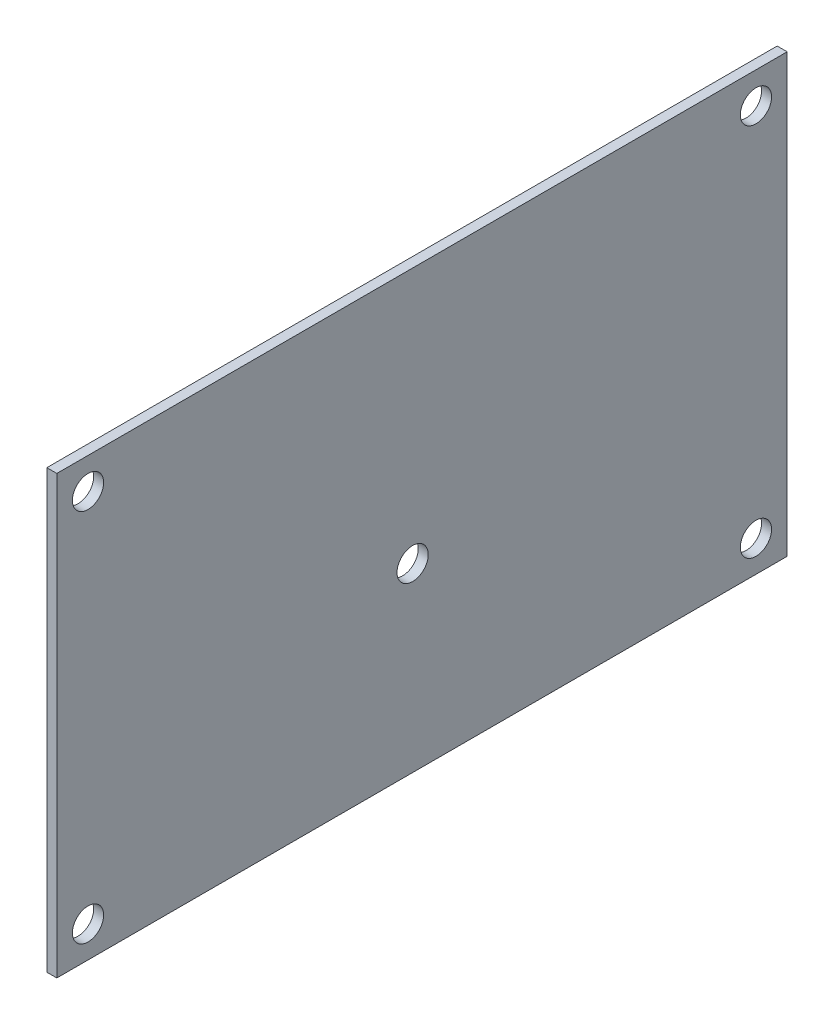
ISO-10303-21;
HEADER;
FILE_DESCRIPTION(('STEP AP214'),'2;1');
FILE_NAME('part.step','',(''),(''),'','','');
FILE_SCHEMA(('AUTOMOTIVE_DESIGN { 1 0 10303 214 1 1 1 1 }'));
ENDSEC;
DATA;
#1=APPLICATION_CONTEXT('core data for automotive mechanical design processes');
#2=APPLICATION_PROTOCOL_DEFINITION('international standard','automotive_design',2000,#1);
#3=PRODUCT_CONTEXT('',#1,'mechanical');
#4=PRODUCT('Part','Part','',(#3));
#5=PRODUCT_RELATED_PRODUCT_CATEGORY('part','',(#4));
#6=PRODUCT_DEFINITION_FORMATION('','',#4);
#7=PRODUCT_DEFINITION_CONTEXT('part definition',#1,'design');
#8=PRODUCT_DEFINITION('design','',#6,#7);
#9=PRODUCT_DEFINITION_SHAPE('','',#8);
#10=(LENGTH_UNIT() NAMED_UNIT(*) SI_UNIT(.MILLI.,.METRE.));
#11=(NAMED_UNIT(*) PLANE_ANGLE_UNIT() SI_UNIT($,.RADIAN.));
#12=(NAMED_UNIT(*) SI_UNIT($,.STERADIAN.) SOLID_ANGLE_UNIT());
#13=UNCERTAINTY_MEASURE_WITH_UNIT(LENGTH_MEASURE(1.E-05),#10,'distance_accuracy_value','');
#14=(GEOMETRIC_REPRESENTATION_CONTEXT(3) GLOBAL_UNCERTAINTY_ASSIGNED_CONTEXT((#13)) GLOBAL_UNIT_ASSIGNED_CONTEXT((#10,
#11,#12)) REPRESENTATION_CONTEXT('',''));
#15=CARTESIAN_POINT('',(0.,0.,0.));
#16=DIRECTION('',(0.,0.,1.));
#17=DIRECTION('',(1.,0.,0.));
#18=AXIS2_PLACEMENT_3D('',#15,#16,#17);
#19=CARTESIAN_POINT('',(1.6,0.,0.));
#20=DIRECTION('',(0.,0.,-1.));
#21=DIRECTION('',(0.,1.,0.));
#22=AXIS2_PLACEMENT_3D('',#19,#20,#21);
#23=PLANE('',#22);
#24=DIRECTION('',(0.,-1.,0.));
#25=VECTOR('',#24,1.);
#26=CARTESIAN_POINT('',(0.,0.,0.));
#27=LINE('',#26,#25);
#28=CARTESIAN_POINT('',(0.,70.,0.));
#29=VERTEX_POINT('',#28);
#30=CARTESIAN_POINT('',(0.,0.,0.));
#31=VERTEX_POINT('',#30);
#32=EDGE_CURVE('E95',#29,#31,#27,.T.);
#33=ORIENTED_EDGE('',*,*,#32,.T.);
#34=DIRECTION('',(-1.,0.,0.));
#35=VECTOR('',#34,1.);
#36=CARTESIAN_POINT('',(1.6,0.,0.));
#37=LINE('',#36,#35);
#38=CARTESIAN_POINT('',(1.6,0.,0.));
#39=VERTEX_POINT('',#38);
#40=EDGE_CURVE('E11',#39,#31,#37,.T.);
#41=ORIENTED_EDGE('',*,*,#40,.F.);
#42=DIRECTION('',(0.,-1.,0.));
#43=VECTOR('',#42,1.);
#44=CARTESIAN_POINT('',(1.6,0.,0.));
#45=LINE('',#44,#43);
#46=CARTESIAN_POINT('',(1.6,70.,0.));
#47=VERTEX_POINT('',#46);
#48=EDGE_CURVE('E83',#47,#39,#45,.T.);
#49=ORIENTED_EDGE('',*,*,#48,.F.);
#50=DIRECTION('',(-1.,0.,0.));
#51=VECTOR('',#50,1.);
#52=CARTESIAN_POINT('',(1.6,70.,0.));
#53=LINE('',#52,#51);
#54=EDGE_CURVE('E91',#47,#29,#53,.T.);
#55=ORIENTED_EDGE('',*,*,#54,.T.);
#56=EDGE_LOOP('',(#33,#41,#49,#55));
#57=FACE_BOUND('',#56,.T.);
#58=ADVANCED_FACE('F32',(#57),#23,.F.);
#59=CARTESIAN_POINT('',(1.6,0.,0.));
#60=DIRECTION('',(0.,1.,0.));
#61=DIRECTION('',(0.,0.,1.));
#62=AXIS2_PLACEMENT_3D('',#59,#60,#61);
#63=PLANE('',#62);
#64=DIRECTION('',(0.,0.,-1.));
#65=VECTOR('',#64,1.);
#66=CARTESIAN_POINT('',(0.,0.,0.));
#67=LINE('',#66,#65);
#68=CARTESIAN_POINT('',(0.,0.,-117.));
#69=VERTEX_POINT('',#68);
#70=EDGE_CURVE('E87',#31,#69,#67,.T.);
#71=ORIENTED_EDGE('',*,*,#70,.T.);
#72=DIRECTION('',(-1.,0.,0.));
#73=VECTOR('',#72,1.);
#74=CARTESIAN_POINT('',(1.6,0.,-117.));
#75=LINE('',#74,#73);
#76=CARTESIAN_POINT('',(1.6,0.,-117.));
#77=VERTEX_POINT('',#76);
#78=EDGE_CURVE('E40',#77,#69,#75,.T.);
#79=ORIENTED_EDGE('',*,*,#78,.F.);
#80=DIRECTION('',(0.,0.,-1.));
#81=VECTOR('',#80,1.);
#82=CARTESIAN_POINT('',(1.6,0.,0.));
#83=LINE('',#82,#81);
#84=EDGE_CURVE('E78',#39,#77,#83,.T.);
#85=ORIENTED_EDGE('',*,*,#84,.F.);
#86=ORIENTED_EDGE('',*,*,#40,.T.);
#87=EDGE_LOOP('',(#71,#79,#85,#86));
#88=FACE_BOUND('',#87,.T.);
#89=ADVANCED_FACE('F86',(#88),#63,.F.);
#90=CARTESIAN_POINT('',(1.6,0.,-117.));
#91=DIRECTION('',(0.,0.,1.));
#92=DIRECTION('',(0.,-1.,0.));
#93=AXIS2_PLACEMENT_3D('',#90,#91,#92);
#94=PLANE('',#93);
#95=DIRECTION('',(0.,1.,0.));
#96=VECTOR('',#95,1.);
#97=CARTESIAN_POINT('',(0.,0.,-117.));
#98=LINE('',#97,#96);
#99=CARTESIAN_POINT('',(0.,70.,-117.));
#100=VERTEX_POINT('',#99);
#101=EDGE_CURVE('E65',#69,#100,#98,.T.);
#102=ORIENTED_EDGE('',*,*,#101,.T.);
#103=DIRECTION('',(-1.,0.,0.));
#104=VECTOR('',#103,1.);
#105=CARTESIAN_POINT('',(1.6,70.,-117.));
#106=LINE('',#105,#104);
#107=CARTESIAN_POINT('',(1.6,70.,-117.));
#108=VERTEX_POINT('',#107);
#109=EDGE_CURVE('E88',#108,#100,#106,.T.);
#110=ORIENTED_EDGE('',*,*,#109,.F.);
#111=DIRECTION('',(0.,1.,0.));
#112=VECTOR('',#111,1.);
#113=CARTESIAN_POINT('',(1.6,0.,-117.));
#114=LINE('',#113,#112);
#115=EDGE_CURVE('E81',#77,#108,#114,.T.);
#116=ORIENTED_EDGE('',*,*,#115,.F.);
#117=ORIENTED_EDGE('',*,*,#78,.T.);
#118=EDGE_LOOP('',(#102,#110,#116,#117));
#119=FACE_BOUND('',#118,.T.);
#120=ADVANCED_FACE('F89',(#119),#94,.F.);
#121=CARTESIAN_POINT('',(1.6,70.,0.));
#122=DIRECTION('',(0.,-1.,0.));
#123=DIRECTION('',(0.,0.,-1.));
#124=AXIS2_PLACEMENT_3D('',#121,#122,#123);
#125=PLANE('',#124);
#126=DIRECTION('',(0.,0.,1.));
#127=VECTOR('',#126,1.);
#128=CARTESIAN_POINT('',(0.,70.,0.));
#129=LINE('',#128,#127);
#130=EDGE_CURVE('E71',#100,#29,#129,.T.);
#131=ORIENTED_EDGE('',*,*,#130,.T.);
#132=ORIENTED_EDGE('',*,*,#54,.F.);
#133=DIRECTION('',(0.,0.,1.));
#134=VECTOR('',#133,1.);
#135=CARTESIAN_POINT('',(1.6,70.,0.));
#136=LINE('',#135,#134);
#137=EDGE_CURVE('E48',#108,#47,#136,.T.);
#138=ORIENTED_EDGE('',*,*,#137,.F.);
#139=ORIENTED_EDGE('',*,*,#109,.T.);
#140=EDGE_LOOP('',(#131,#132,#138,#139));
#141=FACE_BOUND('',#140,.T.);
#142=ADVANCED_FACE('F103',(#141),#125,.F.);
#143=CARTESIAN_POINT('',(1.6,0.,0.));
#144=DIRECTION('',(-1.,0.,0.));
#145=DIRECTION('',(0.,0.,1.));
#146=AXIS2_PLACEMENT_3D('',#143,#144,#145);
#147=PLANE('',#146);
#148=CARTESIAN_POINT('',(1.6,29.,-57.));
#149=DIRECTION('',(1.,0.,0.));
#150=DIRECTION('',(0.,0.,-1.));
#151=AXIS2_PLACEMENT_3D('',#148,#149,#150);
#152=CIRCLE('',#151,2.5);
#153=CARTESIAN_POINT('',(1.6,29.,-59.5));
#154=VERTEX_POINT('',#153);
#155=EDGE_CURVE('E133',#154,#154,#152,.T.);
#156=ORIENTED_EDGE('',*,*,#155,.F.);
#157=EDGE_LOOP('',(#156));
#158=FACE_BOUND('',#157,.T.);
#159=CARTESIAN_POINT('',(1.6,65.,-112.));
#160=DIRECTION('',(1.,0.,0.));
#161=DIRECTION('',(0.,0.,-1.));
#162=AXIS2_PLACEMENT_3D('',#159,#160,#161);
#163=CIRCLE('',#162,2.50000000000001);
#164=CARTESIAN_POINT('',(1.6,65.,-114.5));
#165=VERTEX_POINT('',#164);
#166=EDGE_CURVE('E127',#165,#165,#163,.T.);
#167=ORIENTED_EDGE('',*,*,#166,.F.);
#168=EDGE_LOOP('',(#167));
#169=FACE_BOUND('',#168,.T.);
#170=CARTESIAN_POINT('',(1.6,5.,-112.));
#171=DIRECTION('',(1.,0.,0.));
#172=DIRECTION('',(0.,0.,-1.));
#173=AXIS2_PLACEMENT_3D('',#170,#171,#172);
#174=CIRCLE('',#173,2.49999999999999);
#175=CARTESIAN_POINT('',(1.6,5.,-114.5));
#176=VERTEX_POINT('',#175);
#177=EDGE_CURVE('E121',#176,#176,#174,.T.);
#178=ORIENTED_EDGE('',*,*,#177,.F.);
#179=EDGE_LOOP('',(#178));
#180=FACE_BOUND('',#179,.T.);
#181=CARTESIAN_POINT('',(1.6,5.,-4.99999999999997));
#182=DIRECTION('',(1.,0.,0.));
#183=DIRECTION('',(0.,0.,-1.));
#184=AXIS2_PLACEMENT_3D('',#181,#182,#183);
#185=CIRCLE('',#184,2.5);
#186=CARTESIAN_POINT('',(1.6,5.,-7.49999999999997));
#187=VERTEX_POINT('',#186);
#188=EDGE_CURVE('E115',#187,#187,#185,.T.);
#189=ORIENTED_EDGE('',*,*,#188,.F.);
#190=EDGE_LOOP('',(#189));
#191=FACE_BOUND('',#190,.T.);
#192=CARTESIAN_POINT('',(1.6,65.,-4.99999999999997));
#193=DIRECTION('',(1.,0.,0.));
#194=DIRECTION('',(0.,0.,-1.));
#195=AXIS2_PLACEMENT_3D('',#192,#193,#194);
#196=CIRCLE('',#195,2.5);
#197=CARTESIAN_POINT('',(1.6,65.,-7.49999999999997));
#198=VERTEX_POINT('',#197);
#199=EDGE_CURVE('E109',#198,#198,#196,.T.);
#200=ORIENTED_EDGE('',*,*,#199,.F.);
#201=EDGE_LOOP('',(#200));
#202=FACE_BOUND('',#201,.T.);
#203=ORIENTED_EDGE('',*,*,#48,.T.);
#204=ORIENTED_EDGE('',*,*,#84,.T.);
#205=ORIENTED_EDGE('',*,*,#115,.T.);
#206=ORIENTED_EDGE('',*,*,#137,.T.);
#207=EDGE_LOOP('',(#203,#204,#205,#206));
#208=FACE_BOUND('',#207,.T.);
#209=ADVANCED_FACE('F79',(#158,#169,#180,#191,#202,#208),#147,.F.);
#210=CARTESIAN_POINT('',(0.,0.,0.));
#211=DIRECTION('',(-1.,0.,0.));
#212=DIRECTION('',(0.,0.,1.));
#213=AXIS2_PLACEMENT_3D('',#210,#211,#212);
#214=PLANE('',#213);
#215=CARTESIAN_POINT('',(0.,29.,-57.));
#216=DIRECTION('',(1.,0.,0.));
#217=DIRECTION('',(0.,0.,-1.));
#218=AXIS2_PLACEMENT_3D('',#215,#216,#217);
#219=CIRCLE('',#218,2.5);
#220=CARTESIAN_POINT('',(0.,29.,-59.5));
#221=VERTEX_POINT('',#220);
#222=EDGE_CURVE('E130',#221,#221,#219,.T.);
#223=ORIENTED_EDGE('',*,*,#222,.T.);
#224=EDGE_LOOP('',(#223));
#225=FACE_BOUND('',#224,.T.);
#226=CARTESIAN_POINT('',(0.,65.,-112.));
#227=DIRECTION('',(1.,0.,0.));
#228=DIRECTION('',(0.,0.,-1.));
#229=AXIS2_PLACEMENT_3D('',#226,#227,#228);
#230=CIRCLE('',#229,2.50000000000001);
#231=CARTESIAN_POINT('',(0.,65.,-114.5));
#232=VERTEX_POINT('',#231);
#233=EDGE_CURVE('E124',#232,#232,#230,.T.);
#234=ORIENTED_EDGE('',*,*,#233,.T.);
#235=EDGE_LOOP('',(#234));
#236=FACE_BOUND('',#235,.T.);
#237=CARTESIAN_POINT('',(0.,5.,-112.));
#238=DIRECTION('',(1.,0.,0.));
#239=DIRECTION('',(0.,0.,-1.));
#240=AXIS2_PLACEMENT_3D('',#237,#238,#239);
#241=CIRCLE('',#240,2.49999999999999);
#242=CARTESIAN_POINT('',(0.,5.,-114.5));
#243=VERTEX_POINT('',#242);
#244=EDGE_CURVE('E118',#243,#243,#241,.T.);
#245=ORIENTED_EDGE('',*,*,#244,.T.);
#246=EDGE_LOOP('',(#245));
#247=FACE_BOUND('',#246,.T.);
#248=CARTESIAN_POINT('',(0.,5.,-4.99999999999997));
#249=DIRECTION('',(1.,0.,0.));
#250=DIRECTION('',(0.,0.,-1.));
#251=AXIS2_PLACEMENT_3D('',#248,#249,#250);
#252=CIRCLE('',#251,2.5);
#253=CARTESIAN_POINT('',(0.,5.,-7.49999999999997));
#254=VERTEX_POINT('',#253);
#255=EDGE_CURVE('E112',#254,#254,#252,.T.);
#256=ORIENTED_EDGE('',*,*,#255,.T.);
#257=EDGE_LOOP('',(#256));
#258=FACE_BOUND('',#257,.T.);
#259=CARTESIAN_POINT('',(0.,65.,-4.99999999999997));
#260=DIRECTION('',(1.,0.,0.));
#261=DIRECTION('',(0.,0.,-1.));
#262=AXIS2_PLACEMENT_3D('',#259,#260,#261);
#263=CIRCLE('',#262,2.5);
#264=CARTESIAN_POINT('',(0.,65.,-7.49999999999997));
#265=VERTEX_POINT('',#264);
#266=EDGE_CURVE('E98',#265,#265,#263,.T.);
#267=ORIENTED_EDGE('',*,*,#266,.T.);
#268=EDGE_LOOP('',(#267));
#269=FACE_BOUND('',#268,.T.);
#270=ORIENTED_EDGE('',*,*,#32,.F.);
#271=ORIENTED_EDGE('',*,*,#130,.F.);
#272=ORIENTED_EDGE('',*,*,#101,.F.);
#273=ORIENTED_EDGE('',*,*,#70,.F.);
#274=EDGE_LOOP('',(#270,#271,#272,#273));
#275=FACE_BOUND('',#274,.T.);
#276=ADVANCED_FACE('F106',(#225,#236,#247,#258,#269,#275),#214,.T.);
#277=CARTESIAN_POINT('',(0.,65.,-4.99999999999997));
#278=DIRECTION('',(1.,0.,0.));
#279=DIRECTION('',(0.,0.,-1.));
#280=AXIS2_PLACEMENT_3D('',#277,#278,#279);
#281=CYLINDRICAL_SURFACE('',#280,2.5);
#282=ORIENTED_EDGE('',*,*,#266,.F.);
#283=EDGE_LOOP('',(#282));
#284=FACE_BOUND('',#283,.T.);
#285=ORIENTED_EDGE('',*,*,#199,.T.);
#286=EDGE_LOOP('',(#285));
#287=FACE_BOUND('',#286,.T.);
#288=ADVANCED_FACE('F159',(#284,#287),#281,.F.);
#289=CARTESIAN_POINT('',(0.,5.,-4.99999999999997));
#290=DIRECTION('',(1.,0.,0.));
#291=DIRECTION('',(0.,0.,-1.));
#292=AXIS2_PLACEMENT_3D('',#289,#290,#291);
#293=CYLINDRICAL_SURFACE('',#292,2.5);
#294=ORIENTED_EDGE('',*,*,#255,.F.);
#295=EDGE_LOOP('',(#294));
#296=FACE_BOUND('',#295,.T.);
#297=ORIENTED_EDGE('',*,*,#188,.T.);
#298=EDGE_LOOP('',(#297));
#299=FACE_BOUND('',#298,.T.);
#300=ADVANCED_FACE('F161',(#296,#299),#293,.F.);
#301=CARTESIAN_POINT('',(0.,5.,-112.));
#302=DIRECTION('',(1.,0.,0.));
#303=DIRECTION('',(0.,0.,-1.));
#304=AXIS2_PLACEMENT_3D('',#301,#302,#303);
#305=CYLINDRICAL_SURFACE('',#304,2.49999999999999);
#306=ORIENTED_EDGE('',*,*,#244,.F.);
#307=EDGE_LOOP('',(#306));
#308=FACE_BOUND('',#307,.T.);
#309=ORIENTED_EDGE('',*,*,#177,.T.);
#310=EDGE_LOOP('',(#309));
#311=FACE_BOUND('',#310,.T.);
#312=ADVANCED_FACE('F168',(#308,#311),#305,.F.);
#313=CARTESIAN_POINT('',(0.,65.,-112.));
#314=DIRECTION('',(1.,0.,0.));
#315=DIRECTION('',(0.,0.,-1.));
#316=AXIS2_PLACEMENT_3D('',#313,#314,#315);
#317=CYLINDRICAL_SURFACE('',#316,2.50000000000001);
#318=ORIENTED_EDGE('',*,*,#233,.F.);
#319=EDGE_LOOP('',(#318));
#320=FACE_BOUND('',#319,.T.);
#321=ORIENTED_EDGE('',*,*,#166,.T.);
#322=EDGE_LOOP('',(#321));
#323=FACE_BOUND('',#322,.T.);
#324=ADVANCED_FACE('F144',(#320,#323),#317,.F.);
#325=CARTESIAN_POINT('',(0.,29.,-57.));
#326=DIRECTION('',(1.,0.,0.));
#327=DIRECTION('',(0.,0.,-1.));
#328=AXIS2_PLACEMENT_3D('',#325,#326,#327);
#329=CYLINDRICAL_SURFACE('',#328,2.5);
#330=ORIENTED_EDGE('',*,*,#222,.F.);
#331=EDGE_LOOP('',(#330));
#332=FACE_BOUND('',#331,.T.);
#333=ORIENTED_EDGE('',*,*,#155,.T.);
#334=EDGE_LOOP('',(#333));
#335=FACE_BOUND('',#334,.T.);
#336=ADVANCED_FACE('F141',(#332,#335),#329,.F.);
#337=CLOSED_SHELL('',(#58,#89,#120,#142,#209,#276,#288,#300,#312,#324,#336));
#338=MANIFOLD_SOLID_BREP('B2',#337);
#339=ADVANCED_BREP_SHAPE_REPRESENTATION('',(#18,#338),#14);
#340=SHAPE_DEFINITION_REPRESENTATION(#9,#339);
ENDSEC;
END-ISO-10303-21;
